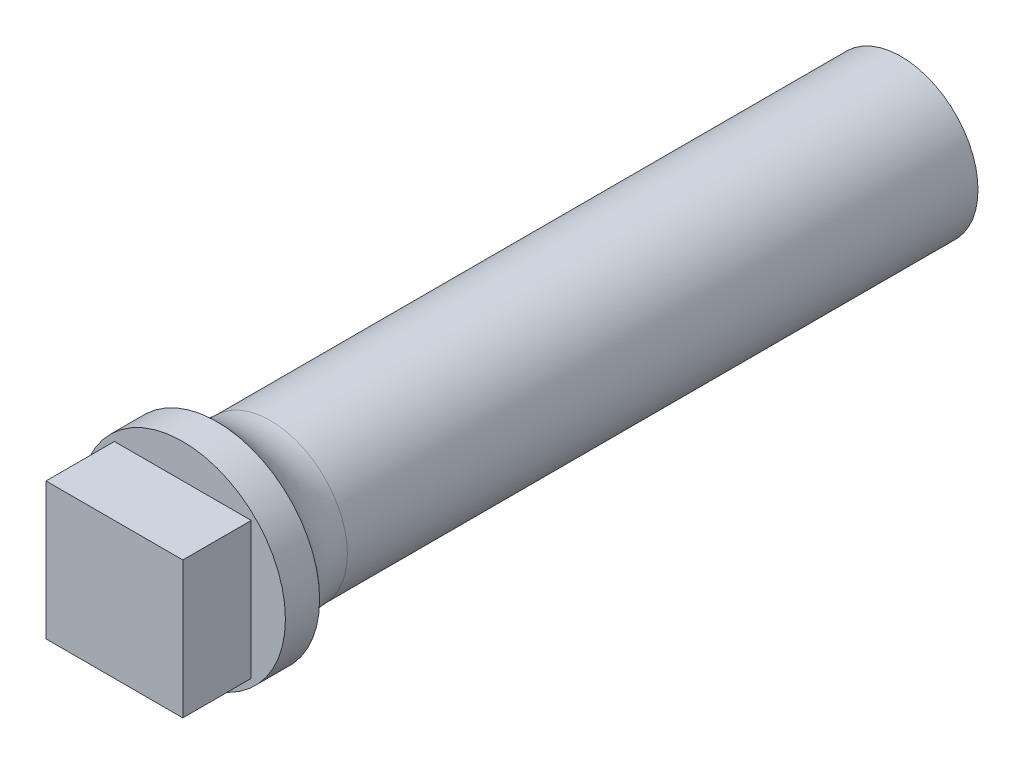
ISO-10303-21;
HEADER;
FILE_DESCRIPTION(('STEP AP214'),'2;1');
FILE_NAME('part.step','',(''),(''),'','','');
FILE_SCHEMA(('AUTOMOTIVE_DESIGN { 1 0 10303 214 1 1 1 1 }'));
ENDSEC;
DATA;
#1=APPLICATION_CONTEXT('core data for automotive mechanical design processes');
#2=APPLICATION_PROTOCOL_DEFINITION('international standard','automotive_design',2000,#1);
#3=PRODUCT_CONTEXT('',#1,'mechanical');
#4=PRODUCT('Part','Part','',(#3));
#5=PRODUCT_RELATED_PRODUCT_CATEGORY('part','',(#4));
#6=PRODUCT_DEFINITION_FORMATION('','',#4);
#7=PRODUCT_DEFINITION_CONTEXT('part definition',#1,'design');
#8=PRODUCT_DEFINITION('design','',#6,#7);
#9=PRODUCT_DEFINITION_SHAPE('','',#8);
#10=(LENGTH_UNIT() NAMED_UNIT(*) SI_UNIT(.MILLI.,.METRE.));
#11=(NAMED_UNIT(*) PLANE_ANGLE_UNIT() SI_UNIT($,.RADIAN.));
#12=(NAMED_UNIT(*) SI_UNIT($,.STERADIAN.) SOLID_ANGLE_UNIT());
#13=UNCERTAINTY_MEASURE_WITH_UNIT(LENGTH_MEASURE(1.E-05),#10,'distance_accuracy_value','');
#14=(GEOMETRIC_REPRESENTATION_CONTEXT(3) GLOBAL_UNCERTAINTY_ASSIGNED_CONTEXT((#13)) GLOBAL_UNIT_ASSIGNED_CONTEXT((#10,
#11,#12)) REPRESENTATION_CONTEXT('',''));
#15=CARTESIAN_POINT('',(0.,0.,0.));
#16=DIRECTION('',(0.,0.,1.));
#17=DIRECTION('',(1.,0.,0.));
#18=AXIS2_PLACEMENT_3D('',#15,#16,#17);
#19=CARTESIAN_POINT('',(0.,0.,20.));
#20=DIRECTION('',(0.,0.,-1.));
#21=DIRECTION('',(-1.,0.,0.));
#22=AXIS2_PLACEMENT_3D('',#19,#20,#21);
#23=CYLINDRICAL_SURFACE('',#22,2.25);
#24=CARTESIAN_POINT('',(0.,0.,18.4387505004004));
#25=DIRECTION('',(0.,0.,1.));
#26=DIRECTION('',(1.,0.,0.));
#27=AXIS2_PLACEMENT_3D('',#24,#25,#26);
#28=CIRCLE('',#27,2.25);
#29=CARTESIAN_POINT('',(2.25,0.,18.4387505004004));
#30=VERTEX_POINT('',#29);
#31=EDGE_CURVE('E11',#30,#30,#28,.F.);
#32=ORIENTED_EDGE('',*,*,#31,.T.);
#33=EDGE_LOOP('',(#32));
#34=FACE_BOUND('',#33,.T.);
#35=CARTESIAN_POINT('',(0.,0.,0.));
#36=DIRECTION('',(0.,0.,1.));
#37=DIRECTION('',(1.,0.,0.));
#38=AXIS2_PLACEMENT_3D('',#35,#36,#37);
#39=CIRCLE('',#38,2.25);
#40=CARTESIAN_POINT('',(2.25,0.,0.));
#41=VERTEX_POINT('',#40);
#42=EDGE_CURVE('E49',#41,#41,#39,.T.);
#43=ORIENTED_EDGE('',*,*,#42,.T.);
#44=EDGE_LOOP('',(#43));
#45=FACE_BOUND('',#44,.T.);
#46=ADVANCED_FACE('F40',(#34,#45),#23,.T.);
#47=CARTESIAN_POINT('',(0.,0.,0.));
#48=DIRECTION('',(0.,0.,1.));
#49=DIRECTION('',(1.,0.,0.));
#50=AXIS2_PLACEMENT_3D('',#47,#48,#49);
#51=PLANE('',#50);
#52=DIRECTION('',(-1.,0.,0.));
#53=VECTOR('',#52,1.);
#54=CARTESIAN_POINT('',(0.,-1.2,0.));
#55=LINE('',#54,#53);
#56=CARTESIAN_POINT('',(1.2,-1.2,0.));
#57=VERTEX_POINT('',#56);
#58=CARTESIAN_POINT('',(-1.2,-1.2,0.));
#59=VERTEX_POINT('',#58);
#60=EDGE_CURVE('E164',#57,#59,#55,.T.);
#61=ORIENTED_EDGE('',*,*,#60,.F.);
#62=DIRECTION('',(0.,-1.,0.));
#63=VECTOR('',#62,1.);
#64=CARTESIAN_POINT('',(1.2,0.,0.));
#65=LINE('',#64,#63);
#66=CARTESIAN_POINT('',(1.2,1.2,0.));
#67=VERTEX_POINT('',#66);
#68=EDGE_CURVE('E142',#67,#57,#65,.T.);
#69=ORIENTED_EDGE('',*,*,#68,.F.);
#70=DIRECTION('',(1.,0.,0.));
#71=VECTOR('',#70,1.);
#72=CARTESIAN_POINT('',(0.,1.2,0.));
#73=LINE('',#72,#71);
#74=CARTESIAN_POINT('',(-1.2,1.2,0.));
#75=VERTEX_POINT('',#74);
#76=EDGE_CURVE('E149',#75,#67,#73,.T.);
#77=ORIENTED_EDGE('',*,*,#76,.F.);
#78=DIRECTION('',(0.,1.,0.));
#79=VECTOR('',#78,1.);
#80=CARTESIAN_POINT('',(-1.2,0.,0.));
#81=LINE('',#80,#79);
#82=EDGE_CURVE('E168',#59,#75,#81,.T.);
#83=ORIENTED_EDGE('',*,*,#82,.F.);
#84=EDGE_LOOP('',(#61,#69,#77,#83));
#85=FACE_BOUND('',#84,.T.);
#86=ORIENTED_EDGE('',*,*,#42,.F.);
#87=EDGE_LOOP('',(#86));
#88=FACE_BOUND('',#87,.T.);
#89=ADVANCED_FACE('F191',(#85,#88),#51,.F.);
#90=CARTESIAN_POINT('',(1.2,0.,2.5));
#91=DIRECTION('',(1.,0.,0.));
#92=DIRECTION('',(0.,0.,-1.));
#93=AXIS2_PLACEMENT_3D('',#90,#91,#92);
#94=PLANE('',#93);
#95=ORIENTED_EDGE('',*,*,#68,.T.);
#96=DIRECTION('',(0.,0.,-1.));
#97=VECTOR('',#96,1.);
#98=CARTESIAN_POINT('',(1.2,-1.2,2.5));
#99=LINE('',#98,#97);
#100=CARTESIAN_POINT('',(1.2,-1.2,2.5));
#101=VERTEX_POINT('',#100);
#102=EDGE_CURVE('E161',#101,#57,#99,.T.);
#103=ORIENTED_EDGE('',*,*,#102,.F.);
#104=DIRECTION('',(0.,-1.,0.));
#105=VECTOR('',#104,1.);
#106=CARTESIAN_POINT('',(1.2,0.,2.5));
#107=LINE('',#106,#105);
#108=CARTESIAN_POINT('',(1.2,1.2,2.5));
#109=VERTEX_POINT('',#108);
#110=EDGE_CURVE('E144',#109,#101,#107,.T.);
#111=ORIENTED_EDGE('',*,*,#110,.F.);
#112=DIRECTION('',(0.,0.,-1.));
#113=VECTOR('',#112,1.);
#114=CARTESIAN_POINT('',(1.2,1.2,2.5));
#115=LINE('',#114,#113);
#116=EDGE_CURVE('E175',#109,#67,#115,.T.);
#117=ORIENTED_EDGE('',*,*,#116,.T.);
#118=EDGE_LOOP('',(#95,#103,#111,#117));
#119=FACE_BOUND('',#118,.T.);
#120=ADVANCED_FACE('F193',(#119),#94,.F.);
#121=CARTESIAN_POINT('',(0.,1.2,2.5));
#122=DIRECTION('',(0.,1.,0.));
#123=DIRECTION('',(-1.,0.,0.));
#124=AXIS2_PLACEMENT_3D('',#121,#122,#123);
#125=PLANE('',#124);
#126=ORIENTED_EDGE('',*,*,#76,.T.);
#127=ORIENTED_EDGE('',*,*,#116,.F.);
#128=DIRECTION('',(1.,0.,0.));
#129=VECTOR('',#128,1.);
#130=CARTESIAN_POINT('',(0.,1.2,2.5));
#131=LINE('',#130,#129);
#132=CARTESIAN_POINT('',(-1.2,1.2,2.5));
#133=VERTEX_POINT('',#132);
#134=EDGE_CURVE('E157',#133,#109,#131,.T.);
#135=ORIENTED_EDGE('',*,*,#134,.F.);
#136=DIRECTION('',(0.,0.,-1.));
#137=VECTOR('',#136,1.);
#138=CARTESIAN_POINT('',(-1.2,1.2,2.5));
#139=LINE('',#138,#137);
#140=EDGE_CURVE('E178',#133,#75,#139,.T.);
#141=ORIENTED_EDGE('',*,*,#140,.T.);
#142=EDGE_LOOP('',(#126,#127,#135,#141));
#143=FACE_BOUND('',#142,.T.);
#144=ADVANCED_FACE('F200',(#143),#125,.F.);
#145=CARTESIAN_POINT('',(-1.2,0.,2.5));
#146=DIRECTION('',(-1.,0.,0.));
#147=DIRECTION('',(0.,0.,1.));
#148=AXIS2_PLACEMENT_3D('',#145,#146,#147);
#149=PLANE('',#148);
#150=ORIENTED_EDGE('',*,*,#82,.T.);
#151=ORIENTED_EDGE('',*,*,#140,.F.);
#152=DIRECTION('',(0.,1.,0.));
#153=VECTOR('',#152,1.);
#154=CARTESIAN_POINT('',(-1.2,0.,2.5));
#155=LINE('',#154,#153);
#156=CARTESIAN_POINT('',(-1.2,-1.2,2.5));
#157=VERTEX_POINT('',#156);
#158=EDGE_CURVE('E153',#157,#133,#155,.T.);
#159=ORIENTED_EDGE('',*,*,#158,.F.);
#160=DIRECTION('',(0.,0.,-1.));
#161=VECTOR('',#160,1.);
#162=CARTESIAN_POINT('',(-1.2,-1.2,2.5));
#163=LINE('',#162,#161);
#164=EDGE_CURVE('E181',#157,#59,#163,.T.);
#165=ORIENTED_EDGE('',*,*,#164,.T.);
#166=EDGE_LOOP('',(#150,#151,#159,#165));
#167=FACE_BOUND('',#166,.T.);
#168=ADVANCED_FACE('F211',(#167),#149,.F.);
#169=CARTESIAN_POINT('',(0.,-1.2,2.5));
#170=DIRECTION('',(0.,-1.,0.));
#171=DIRECTION('',(1.,0.,0.));
#172=AXIS2_PLACEMENT_3D('',#169,#170,#171);
#173=PLANE('',#172);
#174=ORIENTED_EDGE('',*,*,#60,.T.);
#175=ORIENTED_EDGE('',*,*,#164,.F.);
#176=DIRECTION('',(-1.,0.,0.));
#177=VECTOR('',#176,1.);
#178=CARTESIAN_POINT('',(0.,-1.2,2.5));
#179=LINE('',#178,#177);
#180=EDGE_CURVE('E148',#101,#157,#179,.T.);
#181=ORIENTED_EDGE('',*,*,#180,.F.);
#182=ORIENTED_EDGE('',*,*,#102,.T.);
#183=EDGE_LOOP('',(#174,#175,#181,#182));
#184=FACE_BOUND('',#183,.T.);
#185=ADVANCED_FACE('F207',(#184),#173,.F.);
#186=CARTESIAN_POINT('',(0.,0.,2.5));
#187=DIRECTION('',(0.,0.,-1.));
#188=DIRECTION('',(-1.,0.,0.));
#189=AXIS2_PLACEMENT_3D('',#186,#187,#188);
#190=PLANE('',#189);
#191=ORIENTED_EDGE('',*,*,#110,.T.);
#192=ORIENTED_EDGE('',*,*,#180,.T.);
#193=ORIENTED_EDGE('',*,*,#158,.T.);
#194=ORIENTED_EDGE('',*,*,#134,.T.);
#195=EDGE_LOOP('',(#191,#192,#193,#194));
#196=FACE_BOUND('',#195,.T.);
#197=ADVANCED_FACE('F210',(#196),#190,.T.);
#198=CARTESIAN_POINT('',(0.,0.,21.));
#199=DIRECTION('',(0.,0.,-1.));
#200=DIRECTION('',(-1.,0.,0.));
#201=AXIS2_PLACEMENT_3D('',#198,#199,#200);
#202=CYLINDRICAL_SURFACE('',#201,3.);
#203=CARTESIAN_POINT('',(0.,0.,21.));
#204=DIRECTION('',(0.,0.,1.));
#205=DIRECTION('',(1.,0.,0.));
#206=AXIS2_PLACEMENT_3D('',#203,#204,#205);
#207=CIRCLE('',#206,3.);
#208=CARTESIAN_POINT('',(3.,0.,21.));
#209=VERTEX_POINT('',#208);
#210=EDGE_CURVE('E134',#209,#209,#207,.T.);
#211=ORIENTED_EDGE('',*,*,#210,.F.);
#212=EDGE_LOOP('',(#211));
#213=FACE_BOUND('',#212,.T.);
#214=CARTESIAN_POINT('',(0.,0.,20.));
#215=DIRECTION('',(0.,0.,1.));
#216=DIRECTION('',(1.,0.,0.));
#217=AXIS2_PLACEMENT_3D('',#214,#215,#216);
#218=CIRCLE('',#217,3.);
#219=CARTESIAN_POINT('',(3.,0.,20.));
#220=VERTEX_POINT('',#219);
#221=EDGE_CURVE('E129',#220,#220,#218,.T.);
#222=ORIENTED_EDGE('',*,*,#221,.T.);
#223=EDGE_LOOP('',(#222));
#224=FACE_BOUND('',#223,.T.);
#225=ADVANCED_FACE('F221',(#213,#224),#202,.T.);
#226=CARTESIAN_POINT('',(0.,0.,21.));
#227=DIRECTION('',(0.,0.,1.));
#228=DIRECTION('',(1.,0.,0.));
#229=AXIS2_PLACEMENT_3D('',#226,#227,#228);
#230=PLANE('',#229);
#231=DIRECTION('',(0.,-1.,0.));
#232=VECTOR('',#231,1.);
#233=CARTESIAN_POINT('',(-2.,-2.,21.));
#234=LINE('',#233,#232);
#235=CARTESIAN_POINT('',(-2.,2.,21.));
#236=VERTEX_POINT('',#235);
#237=CARTESIAN_POINT('',(-2.,-2.,21.));
#238=VERTEX_POINT('',#237);
#239=EDGE_CURVE('E56',#236,#238,#234,.T.);
#240=ORIENTED_EDGE('',*,*,#239,.F.);
#241=DIRECTION('',(-1.,0.,0.));
#242=VECTOR('',#241,1.);
#243=CARTESIAN_POINT('',(2.,2.,21.));
#244=LINE('',#243,#242);
#245=CARTESIAN_POINT('',(2.,2.,21.));
#246=VERTEX_POINT('',#245);
#247=EDGE_CURVE('E60',#246,#236,#244,.T.);
#248=ORIENTED_EDGE('',*,*,#247,.F.);
#249=DIRECTION('',(0.,1.,0.));
#250=VECTOR('',#249,1.);
#251=CARTESIAN_POINT('',(2.,-2.,21.));
#252=LINE('',#251,#250);
#253=CARTESIAN_POINT('',(2.,-2.,21.));
#254=VERTEX_POINT('',#253);
#255=EDGE_CURVE('E339',#254,#246,#252,.T.);
#256=ORIENTED_EDGE('',*,*,#255,.F.);
#257=DIRECTION('',(1.,0.,0.));
#258=VECTOR('',#257,1.);
#259=CARTESIAN_POINT('',(2.,-2.,21.));
#260=LINE('',#259,#258);
#261=EDGE_CURVE('E349',#238,#254,#260,.T.);
#262=ORIENTED_EDGE('',*,*,#261,.F.);
#263=EDGE_LOOP('',(#240,#248,#256,#262));
#264=FACE_BOUND('',#263,.T.);
#265=ORIENTED_EDGE('',*,*,#210,.T.);
#266=EDGE_LOOP('',(#265));
#267=FACE_BOUND('',#266,.T.);
#268=ADVANCED_FACE('F225',(#264,#267),#230,.T.);
#269=CARTESIAN_POINT('',(-2.,-2.,23.));
#270=DIRECTION('',(1.,0.,0.));
#271=DIRECTION('',(0.,0.,-1.));
#272=AXIS2_PLACEMENT_3D('',#269,#270,#271);
#273=PLANE('',#272);
#274=ORIENTED_EDGE('',*,*,#239,.T.);
#275=DIRECTION('',(0.,0.,-1.));
#276=VECTOR('',#275,1.);
#277=CARTESIAN_POINT('',(-2.,-2.,23.));
#278=LINE('',#277,#276);
#279=CARTESIAN_POINT('',(-2.,-2.,23.));
#280=VERTEX_POINT('',#279);
#281=EDGE_CURVE('E109',#280,#238,#278,.T.);
#282=ORIENTED_EDGE('',*,*,#281,.F.);
#283=DIRECTION('',(0.,-1.,0.));
#284=VECTOR('',#283,1.);
#285=CARTESIAN_POINT('',(-2.,-2.,23.));
#286=LINE('',#285,#284);
#287=CARTESIAN_POINT('',(-2.,2.,23.));
#288=VERTEX_POINT('',#287);
#289=EDGE_CURVE('E116',#288,#280,#286,.T.);
#290=ORIENTED_EDGE('',*,*,#289,.F.);
#291=DIRECTION('',(0.,0.,-1.));
#292=VECTOR('',#291,1.);
#293=CARTESIAN_POINT('',(-2.,2.,23.));
#294=LINE('',#293,#292);
#295=EDGE_CURVE('E336',#288,#236,#294,.T.);
#296=ORIENTED_EDGE('',*,*,#295,.T.);
#297=EDGE_LOOP('',(#274,#282,#290,#296));
#298=FACE_BOUND('',#297,.T.);
#299=ADVANCED_FACE('F127',(#298),#273,.F.);
#300=CARTESIAN_POINT('',(2.,-2.,23.));
#301=DIRECTION('',(0.,1.,0.));
#302=DIRECTION('',(-1.,0.,0.));
#303=AXIS2_PLACEMENT_3D('',#300,#301,#302);
#304=PLANE('',#303);
#305=ORIENTED_EDGE('',*,*,#261,.T.);
#306=DIRECTION('',(0.,0.,-1.));
#307=VECTOR('',#306,1.);
#308=CARTESIAN_POINT('',(2.,-2.,23.));
#309=LINE('',#308,#307);
#310=CARTESIAN_POINT('',(2.,-2.,23.));
#311=VERTEX_POINT('',#310);
#312=EDGE_CURVE('E111',#311,#254,#309,.T.);
#313=ORIENTED_EDGE('',*,*,#312,.F.);
#314=DIRECTION('',(1.,0.,0.));
#315=VECTOR('',#314,1.);
#316=CARTESIAN_POINT('',(2.,-2.,23.));
#317=LINE('',#316,#315);
#318=EDGE_CURVE('E104',#280,#311,#317,.T.);
#319=ORIENTED_EDGE('',*,*,#318,.F.);
#320=ORIENTED_EDGE('',*,*,#281,.T.);
#321=EDGE_LOOP('',(#305,#313,#319,#320));
#322=FACE_BOUND('',#321,.T.);
#323=ADVANCED_FACE('F107',(#322),#304,.F.);
#324=CARTESIAN_POINT('',(2.,-2.,23.));
#325=DIRECTION('',(-1.,0.,0.));
#326=DIRECTION('',(0.,-1.,0.));
#327=AXIS2_PLACEMENT_3D('',#324,#325,#326);
#328=PLANE('',#327);
#329=ORIENTED_EDGE('',*,*,#255,.T.);
#330=DIRECTION('',(0.,0.,-1.));
#331=VECTOR('',#330,1.);
#332=CARTESIAN_POINT('',(2.,2.,23.));
#333=LINE('',#332,#331);
#334=CARTESIAN_POINT('',(2.,2.,23.));
#335=VERTEX_POINT('',#334);
#336=EDGE_CURVE('E136',#335,#246,#333,.T.);
#337=ORIENTED_EDGE('',*,*,#336,.F.);
#338=DIRECTION('',(0.,1.,0.));
#339=VECTOR('',#338,1.);
#340=CARTESIAN_POINT('',(2.,-2.,23.));
#341=LINE('',#340,#339);
#342=EDGE_CURVE('E115',#311,#335,#341,.T.);
#343=ORIENTED_EDGE('',*,*,#342,.F.);
#344=ORIENTED_EDGE('',*,*,#312,.T.);
#345=EDGE_LOOP('',(#329,#337,#343,#344));
#346=FACE_BOUND('',#345,.T.);
#347=ADVANCED_FACE('F233',(#346),#328,.F.);
#348=CARTESIAN_POINT('',(2.,2.,23.));
#349=DIRECTION('',(0.,-1.,0.));
#350=DIRECTION('',(1.,0.,0.));
#351=AXIS2_PLACEMENT_3D('',#348,#349,#350);
#352=PLANE('',#351);
#353=ORIENTED_EDGE('',*,*,#247,.T.);
#354=ORIENTED_EDGE('',*,*,#295,.F.);
#355=DIRECTION('',(-1.,0.,0.));
#356=VECTOR('',#355,1.);
#357=CARTESIAN_POINT('',(2.,2.,23.));
#358=LINE('',#357,#356);
#359=EDGE_CURVE('E121',#335,#288,#358,.T.);
#360=ORIENTED_EDGE('',*,*,#359,.F.);
#361=ORIENTED_EDGE('',*,*,#336,.T.);
#362=EDGE_LOOP('',(#353,#354,#360,#361));
#363=FACE_BOUND('',#362,.T.);
#364=ADVANCED_FACE('F236',(#363),#352,.F.);
#365=CARTESIAN_POINT('',(0.,0.,23.));
#366=DIRECTION('',(0.,0.,1.));
#367=DIRECTION('',(1.,0.,0.));
#368=AXIS2_PLACEMENT_3D('',#365,#366,#367);
#369=PLANE('',#368);
#370=ORIENTED_EDGE('',*,*,#289,.T.);
#371=ORIENTED_EDGE('',*,*,#318,.T.);
#372=ORIENTED_EDGE('',*,*,#342,.T.);
#373=ORIENTED_EDGE('',*,*,#359,.T.);
#374=EDGE_LOOP('',(#370,#371,#372,#373));
#375=FACE_BOUND('',#374,.T.);
#376=ADVANCED_FACE('F119',(#375),#369,.T.);
#377=CARTESIAN_POINT('',(0.,0.,18.4387505004004));
#378=DIRECTION('',(0.,0.,1.));
#379=DIRECTION('',(1.,0.,0.));
#380=AXIS2_PLACEMENT_3D('',#377,#378,#379);
#381=TOROIDAL_SURFACE('',#380,4.25,2.);
#382=ORIENTED_EDGE('',*,*,#31,.F.);
#383=EDGE_LOOP('',(#382));
#384=FACE_BOUND('',#383,.T.);
#385=ORIENTED_EDGE('',*,*,#221,.F.);
#386=EDGE_LOOP('',(#385));
#387=FACE_BOUND('',#386,.T.);
#388=ADVANCED_FACE('F42',(#384,#387),#381,.F.);
#389=CLOSED_SHELL('',(#46,#89,#120,#144,#168,#185,#197,#225,#268,#299,#323,#347,#364,#376,#388));
#390=MANIFOLD_SOLID_BREP('B2',#389);
#391=ADVANCED_BREP_SHAPE_REPRESENTATION('',(#18,#390),#14);
#392=SHAPE_DEFINITION_REPRESENTATION(#9,#391);
ENDSEC;
END-ISO-10303-21;
